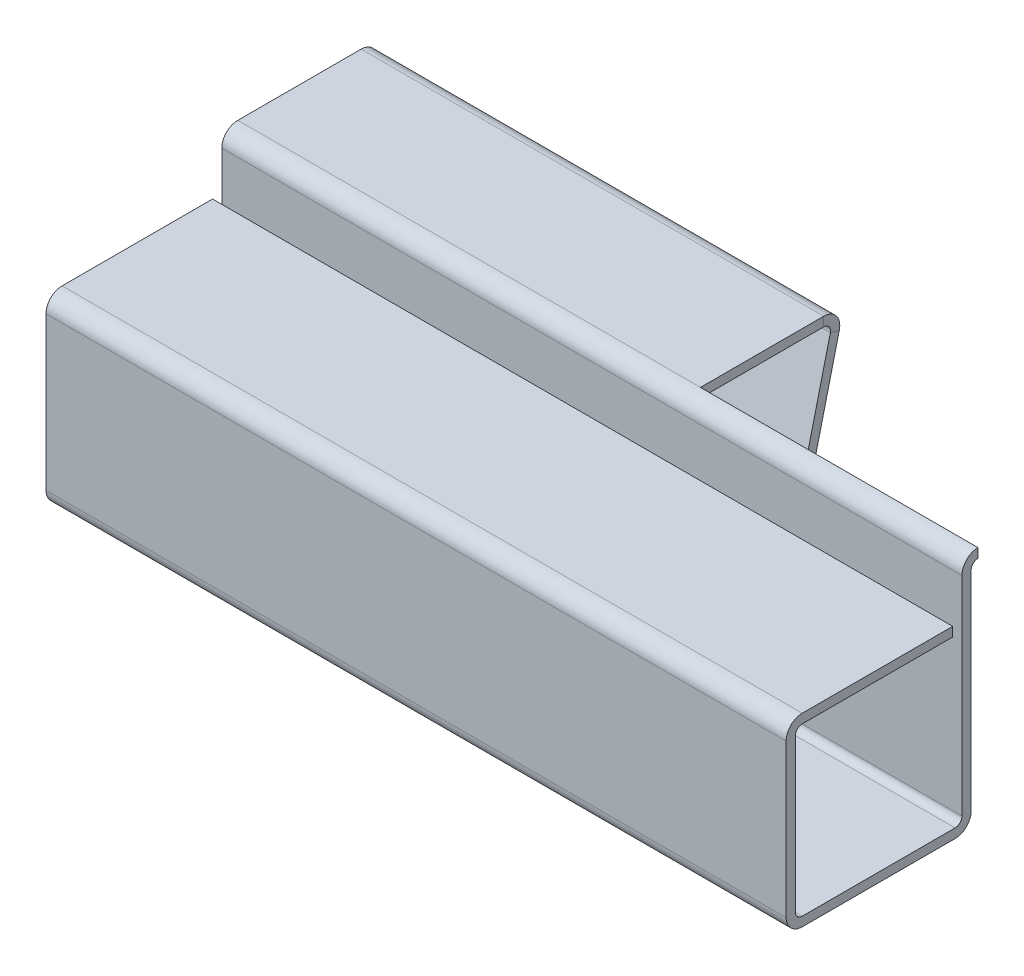
ISO-10303-21;
HEADER;
FILE_DESCRIPTION(('STEP AP214'),'2;1');
FILE_NAME('part.step','',(''),(''),'','','');
FILE_SCHEMA(('AUTOMOTIVE_DESIGN { 1 0 10303 214 1 1 1 1 }'));
ENDSEC;
DATA;
#1=APPLICATION_CONTEXT('core data for automotive mechanical design processes');
#2=APPLICATION_PROTOCOL_DEFINITION('international standard','automotive_design',2000,#1);
#3=PRODUCT_CONTEXT('',#1,'mechanical');
#4=PRODUCT('Part','Part','',(#3));
#5=PRODUCT_RELATED_PRODUCT_CATEGORY('part','',(#4));
#6=PRODUCT_DEFINITION_FORMATION('','',#4);
#7=PRODUCT_DEFINITION_CONTEXT('part definition',#1,'design');
#8=PRODUCT_DEFINITION('design','',#6,#7);
#9=PRODUCT_DEFINITION_SHAPE('','',#8);
#10=(LENGTH_UNIT() NAMED_UNIT(*) SI_UNIT(.MILLI.,.METRE.));
#11=(NAMED_UNIT(*) PLANE_ANGLE_UNIT() SI_UNIT($,.RADIAN.));
#12=(NAMED_UNIT(*) SI_UNIT($,.STERADIAN.) SOLID_ANGLE_UNIT());
#13=UNCERTAINTY_MEASURE_WITH_UNIT(LENGTH_MEASURE(1.E-05),#10,'distance_accuracy_value','');
#14=(GEOMETRIC_REPRESENTATION_CONTEXT(3) GLOBAL_UNCERTAINTY_ASSIGNED_CONTEXT((#13)) GLOBAL_UNIT_ASSIGNED_CONTEXT((#10,
#11,#12)) REPRESENTATION_CONTEXT('',''));
#15=CARTESIAN_POINT('',(0.,0.,0.));
#16=DIRECTION('',(0.,0.,1.));
#17=DIRECTION('',(1.,0.,0.));
#18=AXIS2_PLACEMENT_3D('',#15,#16,#17);
#19=CARTESIAN_POINT('',(50.,35.,-7.6326695579513));
#20=DIRECTION('',(1.,0.,0.));
#21=DIRECTION('',(0.,0.,-1.));
#22=AXIS2_PLACEMENT_3D('',#19,#20,#21);
#23=PLANE('',#22);
#24=DIRECTION('',(0.,1.,0.));
#25=VECTOR('',#24,1.);
#26=CARTESIAN_POINT('',(50.,35.,-7.6326695579513));
#27=LINE('',#26,#25);
#28=CARTESIAN_POINT('',(50.,35.,-7.6326695579513));
#29=VERTEX_POINT('',#28);
#30=CARTESIAN_POINT('',(50.,36.,-7.6326695579513));
#31=VERTEX_POINT('',#30);
#32=EDGE_CURVE('E11',#29,#31,#27,.T.);
#33=ORIENTED_EDGE('',*,*,#32,.F.);
#34=CARTESIAN_POINT('',(50.,34.2634,-7.6326695579513));
#35=DIRECTION('',(-1.,0.,0.));
#36=DIRECTION('',(0.,0.,1.));
#37=AXIS2_PLACEMENT_3D('',#34,#35,#36);
#38=CIRCLE('',#37,0.7366);
#39=CARTESIAN_POINT('',(50.,34.0881858939392,-8.34812715769941));
#40=VERTEX_POINT('',#39);
#41=EDGE_CURVE('E171',#40,#29,#38,.F.);
#42=ORIENTED_EDGE('',*,*,#41,.F.);
#43=DIRECTION('',(0.,0.237868729379253,0.971297311631974));
#44=VECTOR('',#43,1.);
#45=CARTESIAN_POINT('',(50.,33.85031716456,-9.31942446933138));
#46=LINE('',#45,#44);
#47=CARTESIAN_POINT('',(50.,33.85031716456,-9.31942446933138));
#48=VERTEX_POINT('',#47);
#49=EDGE_CURVE('E49',#48,#40,#46,.T.);
#50=ORIENTED_EDGE('',*,*,#49,.F.);
#51=CARTESIAN_POINT('',(50.,34.2634,-7.6326695579513));
#52=DIRECTION('',(1.,0.,0.));
#53=DIRECTION('',(0.,0.,-1.));
#54=AXIS2_PLACEMENT_3D('',#51,#52,#53);
#55=CIRCLE('',#54,1.7366);
#56=EDGE_CURVE('E168',#48,#31,#55,.T.);
#57=ORIENTED_EDGE('',*,*,#56,.T.);
#58=EDGE_LOOP('',(#33,#42,#50,#57));
#59=FACE_BOUND('',#58,.T.);
#60=ADVANCED_FACE('F41',(#59),#23,.T.);
#61=CARTESIAN_POINT('',(50.,33.85031716456,-9.31942446933138));
#62=DIRECTION('',(1.,0.,0.));
#63=DIRECTION('',(0.,0.,-1.));
#64=AXIS2_PLACEMENT_3D('',#61,#62,#63);
#65=PLANE('',#64);
#66=DIRECTION('',(0.,0.,1.));
#67=VECTOR('',#66,1.);
#68=CARTESIAN_POINT('',(50.,35.,-8.57142857142857));
#69=LINE('',#68,#67);
#70=CARTESIAN_POINT('',(50.,35.,5.69197142857143));
#71=VERTEX_POINT('',#70);
#72=EDGE_CURVE('E271',#29,#71,#69,.T.);
#73=ORIENTED_EDGE('',*,*,#72,.F.);
#74=ORIENTED_EDGE('',*,*,#32,.T.);
#75=DIRECTION('',(0.,0.,-1.));
#76=VECTOR('',#75,1.);
#77=CARTESIAN_POINT('',(50.,36.,-8.57142857142857));
#78=LINE('',#77,#76);
#79=CARTESIAN_POINT('',(50.,36.,5.69197142857143));
#80=VERTEX_POINT('',#79);
#81=EDGE_CURVE('E56',#31,#80,#78,.F.);
#82=ORIENTED_EDGE('',*,*,#81,.T.);
#83=DIRECTION('',(0.,-1.,0.));
#84=VECTOR('',#83,1.);
#85=CARTESIAN_POINT('',(50.,36.,5.69197142857143));
#86=LINE('',#85,#84);
#87=EDGE_CURVE('E146',#80,#71,#86,.T.);
#88=ORIENTED_EDGE('',*,*,#87,.T.);
#89=EDGE_LOOP('',(#73,#74,#82,#88));
#90=FACE_BOUND('',#89,.T.);
#91=ADVANCED_FACE('F413',(#90),#65,.T.);
#92=CARTESIAN_POINT('',(0.,34.0881858939392,-8.34812715769941));
#93=DIRECTION('',(-1.,0.,0.));
#94=DIRECTION('',(0.,0.,1.));
#95=AXIS2_PLACEMENT_3D('',#92,#93,#94);
#96=PLANE('',#95);
#97=DIRECTION('',(0.,-0.237868729379253,-0.971297311631974));
#98=VECTOR('',#97,1.);
#99=CARTESIAN_POINT('',(0.,34.0881858939392,-8.34812715769941));
#100=LINE('',#99,#98);
#101=CARTESIAN_POINT('',(0.,34.0881858939392,-8.34812715769941));
#102=VERTEX_POINT('',#101);
#103=CARTESIAN_POINT('',(0.,33.85031716456,-9.31942446933138));
#104=VERTEX_POINT('',#103);
#105=EDGE_CURVE('E176',#102,#104,#100,.T.);
#106=ORIENTED_EDGE('',*,*,#105,.F.);
#107=CARTESIAN_POINT('',(0.,34.2634,-7.6326695579513));
#108=DIRECTION('',(-1.,0.,0.));
#109=DIRECTION('',(0.,0.,1.));
#110=AXIS2_PLACEMENT_3D('',#107,#108,#109);
#111=CIRCLE('',#110,0.7366);
#112=CARTESIAN_POINT('',(0.,35.,-7.6326695579513));
#113=VERTEX_POINT('',#112);
#114=EDGE_CURVE('E237',#102,#113,#111,.F.);
#115=ORIENTED_EDGE('',*,*,#114,.T.);
#116=DIRECTION('',(0.,-1.,0.));
#117=VECTOR('',#116,1.);
#118=CARTESIAN_POINT('',(0.,36.,-7.6326695579513));
#119=LINE('',#118,#117);
#120=CARTESIAN_POINT('',(0.,36.,-7.6326695579513));
#121=VERTEX_POINT('',#120);
#122=EDGE_CURVE('E348',#121,#113,#119,.T.);
#123=ORIENTED_EDGE('',*,*,#122,.F.);
#124=CARTESIAN_POINT('',(0.,34.2634,-7.6326695579513));
#125=DIRECTION('',(1.,0.,0.));
#126=DIRECTION('',(0.,0.,-1.));
#127=AXIS2_PLACEMENT_3D('',#124,#125,#126);
#128=CIRCLE('',#127,1.7366);
#129=EDGE_CURVE('E247',#104,#121,#128,.T.);
#130=ORIENTED_EDGE('',*,*,#129,.F.);
#131=EDGE_LOOP('',(#106,#115,#123,#130));
#132=FACE_BOUND('',#131,.T.);
#133=ADVANCED_FACE('F355',(#132),#96,.T.);
#134=CARTESIAN_POINT('',(0.,36.,-7.6326695579513));
#135=DIRECTION('',(-1.,0.,0.));
#136=DIRECTION('',(0.,0.,1.));
#137=AXIS2_PLACEMENT_3D('',#134,#135,#136);
#138=PLANE('',#137);
#139=DIRECTION('',(0.,0.971297311631973,-0.237868729379259));
#140=VECTOR('',#139,1.);
#141=CARTESIAN_POINT('',(0.,0.,0.));
#142=LINE('',#141,#140);
#143=CARTESIAN_POINT('',(0.,0.,0.));
#144=VERTEX_POINT('',#143);
#145=EDGE_CURVE('E240',#144,#102,#142,.T.);
#146=ORIENTED_EDGE('',*,*,#145,.T.);
#147=ORIENTED_EDGE('',*,*,#105,.T.);
#148=DIRECTION('',(0.,0.971297311631973,-0.237868729379259));
#149=VECTOR('',#148,1.);
#150=CARTESIAN_POINT('',(0.,-0.237868729379259,-0.971297311631973));
#151=LINE('',#150,#149);
#152=CARTESIAN_POINT('',(0.,-0.237868729379259,-0.971297311631973));
#153=VERTEX_POINT('',#152);
#154=EDGE_CURVE('E191',#153,#104,#151,.T.);
#155=ORIENTED_EDGE('',*,*,#154,.F.);
#156=DIRECTION('',(0.,0.237868729379259,0.971297311631973));
#157=VECTOR('',#156,1.);
#158=CARTESIAN_POINT('',(0.,-0.237868729379259,-0.971297311631973));
#159=LINE('',#158,#157);
#160=EDGE_CURVE('E243',#153,#144,#159,.T.);
#161=ORIENTED_EDGE('',*,*,#160,.T.);
#162=EDGE_LOOP('',(#146,#147,#155,#161));
#163=FACE_BOUND('',#162,.T.);
#164=ADVANCED_FACE('F351',(#163),#138,.T.);
#165=CARTESIAN_POINT('',(0.,35.,5.69197142857143));
#166=DIRECTION('',(-1.,0.,0.));
#167=DIRECTION('',(0.,0.,1.));
#168=AXIS2_PLACEMENT_3D('',#165,#166,#167);
#169=PLANE('',#168);
#170=DIRECTION('',(0.,1.,0.));
#171=VECTOR('',#170,1.);
#172=CARTESIAN_POINT('',(0.,35.,5.69197142857143));
#173=LINE('',#172,#171);
#174=CARTESIAN_POINT('',(0.,35.,5.69197142857143));
#175=VERTEX_POINT('',#174);
#176=CARTESIAN_POINT('',(0.,36.,5.69197142857143));
#177=VERTEX_POINT('',#176);
#178=EDGE_CURVE('E345',#175,#177,#173,.T.);
#179=ORIENTED_EDGE('',*,*,#178,.F.);
#180=CARTESIAN_POINT('',(0.,34.2634,5.69197142857143));
#181=DIRECTION('',(-1.,0.,0.));
#182=DIRECTION('',(0.,0.,1.));
#183=AXIS2_PLACEMENT_3D('',#180,#181,#182);
#184=CIRCLE('',#183,0.7366);
#185=CARTESIAN_POINT('',(0.,34.2634,6.42857142857143));
#186=VERTEX_POINT('',#185);
#187=EDGE_CURVE('E231',#175,#186,#184,.F.);
#188=ORIENTED_EDGE('',*,*,#187,.T.);
#189=DIRECTION('',(0.,0.,-1.));
#190=VECTOR('',#189,1.);
#191=CARTESIAN_POINT('',(0.,34.2634,7.42857142857143));
#192=LINE('',#191,#190);
#193=CARTESIAN_POINT('',(0.,34.2634,7.42857142857143));
#194=VERTEX_POINT('',#193);
#195=EDGE_CURVE('E343',#194,#186,#192,.T.);
#196=ORIENTED_EDGE('',*,*,#195,.F.);
#197=CARTESIAN_POINT('',(0.,34.2634,5.69197142857143));
#198=DIRECTION('',(1.,0.,0.));
#199=DIRECTION('',(0.,0.,-1.));
#200=AXIS2_PLACEMENT_3D('',#197,#198,#199);
#201=CIRCLE('',#200,1.7366);
#202=EDGE_CURVE('E252',#177,#194,#201,.T.);
#203=ORIENTED_EDGE('',*,*,#202,.F.);
#204=EDGE_LOOP('',(#179,#188,#196,#203));
#205=FACE_BOUND('',#204,.T.);
#206=ADVANCED_FACE('F426',(#205),#169,.T.);
#207=CARTESIAN_POINT('',(0.,34.2634,7.42857142857143));
#208=DIRECTION('',(-1.,0.,0.));
#209=DIRECTION('',(0.,0.,1.));
#210=AXIS2_PLACEMENT_3D('',#207,#208,#209);
#211=PLANE('',#210);
#212=DIRECTION('',(0.,0.,1.));
#213=VECTOR('',#212,1.);
#214=CARTESIAN_POINT('',(0.,35.,-8.57142857142857));
#215=LINE('',#214,#213);
#216=EDGE_CURVE('E234',#113,#175,#215,.T.);
#217=ORIENTED_EDGE('',*,*,#216,.T.);
#218=ORIENTED_EDGE('',*,*,#178,.T.);
#219=DIRECTION('',(0.,0.,-1.));
#220=VECTOR('',#219,1.);
#221=CARTESIAN_POINT('',(0.,36.,-8.57142857142857));
#222=LINE('',#221,#220);
#223=EDGE_CURVE('E249',#121,#177,#222,.F.);
#224=ORIENTED_EDGE('',*,*,#223,.F.);
#225=ORIENTED_EDGE('',*,*,#122,.T.);
#226=EDGE_LOOP('',(#217,#218,#224,#225));
#227=FACE_BOUND('',#226,.T.);
#228=ADVANCED_FACE('F369',(#227),#211,.T.);
#229=CARTESIAN_POINT('',(0.,11.7366,6.42857142857142));
#230=DIRECTION('',(-1.,0.,0.));
#231=DIRECTION('',(0.,0.,1.));
#232=AXIS2_PLACEMENT_3D('',#229,#230,#231);
#233=PLANE('',#232);
#234=DIRECTION('',(0.,0.,1.));
#235=VECTOR('',#234,1.);
#236=CARTESIAN_POINT('',(0.,11.7366,6.42857142857142));
#237=LINE('',#236,#235);
#238=CARTESIAN_POINT('',(0.,11.7366,6.42857142857142));
#239=VERTEX_POINT('',#238);
#240=CARTESIAN_POINT('',(0.,11.7366,7.42857142857142));
#241=VERTEX_POINT('',#240);
#242=EDGE_CURVE('E341',#239,#241,#237,.T.);
#243=ORIENTED_EDGE('',*,*,#242,.F.);
#244=CARTESIAN_POINT('',(0.,11.7366,8.16517142857142));
#245=DIRECTION('',(1.,0.,0.));
#246=DIRECTION('',(0.,0.,-1.));
#247=AXIS2_PLACEMENT_3D('',#244,#245,#246);
#248=CIRCLE('',#247,1.7366);
#249=CARTESIAN_POINT('',(0.,10.,8.16517142857142));
#250=VERTEX_POINT('',#249);
#251=EDGE_CURVE('E225',#239,#250,#248,.F.);
#252=ORIENTED_EDGE('',*,*,#251,.T.);
#253=DIRECTION('',(0.,-1.,0.));
#254=VECTOR('',#253,1.);
#255=CARTESIAN_POINT('',(0.,11.,8.16517142857142));
#256=LINE('',#255,#254);
#257=CARTESIAN_POINT('',(0.,11.,8.16517142857142));
#258=VERTEX_POINT('',#257);
#259=EDGE_CURVE('E339',#258,#250,#256,.T.);
#260=ORIENTED_EDGE('',*,*,#259,.F.);
#261=CARTESIAN_POINT('',(0.,11.7366,8.16517142857142));
#262=DIRECTION('',(1.,0.,0.));
#263=DIRECTION('',(0.,0.,-1.));
#264=AXIS2_PLACEMENT_3D('',#261,#262,#263);
#265=CIRCLE('',#264,0.7366);
#266=EDGE_CURVE('E258',#241,#258,#265,.F.);
#267=ORIENTED_EDGE('',*,*,#266,.F.);
#268=EDGE_LOOP('',(#243,#252,#260,#267));
#269=FACE_BOUND('',#268,.T.);
#270=ADVANCED_FACE('F432',(#269),#233,.T.);
#271=CARTESIAN_POINT('',(0.,11.,8.16517142857142));
#272=DIRECTION('',(-1.,0.,0.));
#273=DIRECTION('',(0.,0.,1.));
#274=AXIS2_PLACEMENT_3D('',#271,#272,#273);
#275=PLANE('',#274);
#276=DIRECTION('',(0.,-1.,0.));
#277=VECTOR('',#276,1.);
#278=CARTESIAN_POINT('',(0.,35.,6.42857142857143));
#279=LINE('',#278,#277);
#280=EDGE_CURVE('E228',#186,#239,#279,.T.);
#281=ORIENTED_EDGE('',*,*,#280,.T.);
#282=ORIENTED_EDGE('',*,*,#242,.T.);
#283=DIRECTION('',(0.,-1.,0.));
#284=VECTOR('',#283,1.);
#285=CARTESIAN_POINT('',(0.,35.,7.42857142857143));
#286=LINE('',#285,#284);
#287=EDGE_CURVE('E255',#194,#241,#286,.T.);
#288=ORIENTED_EDGE('',*,*,#287,.F.);
#289=ORIENTED_EDGE('',*,*,#195,.T.);
#290=EDGE_LOOP('',(#281,#282,#288,#289));
#291=FACE_BOUND('',#290,.T.);
#292=ADVANCED_FACE('F435',(#291),#275,.T.);
#293=CARTESIAN_POINT('',(0.,10.,24.6919714285714));
#294=DIRECTION('',(-1.,0.,0.));
#295=DIRECTION('',(0.,0.,1.));
#296=AXIS2_PLACEMENT_3D('',#293,#294,#295);
#297=PLANE('',#296);
#298=DIRECTION('',(0.,1.,0.));
#299=VECTOR('',#298,1.);
#300=CARTESIAN_POINT('',(0.,10.,24.6919714285714));
#301=LINE('',#300,#299);
#302=CARTESIAN_POINT('',(0.,10.,24.6919714285714));
#303=VERTEX_POINT('',#302);
#304=CARTESIAN_POINT('',(0.,11.,24.6919714285714));
#305=VERTEX_POINT('',#304);
#306=EDGE_CURVE('E337',#303,#305,#301,.T.);
#307=ORIENTED_EDGE('',*,*,#306,.F.);
#308=CARTESIAN_POINT('',(0.,11.7366,24.6919714285714));
#309=DIRECTION('',(1.,0.,0.));
#310=DIRECTION('',(0.,0.,-1.));
#311=AXIS2_PLACEMENT_3D('',#308,#309,#310);
#312=CIRCLE('',#311,1.7366);
#313=CARTESIAN_POINT('',(0.,11.7366,26.4285714285714));
#314=VERTEX_POINT('',#313);
#315=EDGE_CURVE('E219',#303,#314,#312,.F.);
#316=ORIENTED_EDGE('',*,*,#315,.T.);
#317=DIRECTION('',(0.,0.,1.));
#318=VECTOR('',#317,1.);
#319=CARTESIAN_POINT('',(0.,11.7366,25.4285714285714));
#320=LINE('',#319,#318);
#321=CARTESIAN_POINT('',(0.,11.7366,25.4285714285714));
#322=VERTEX_POINT('',#321);
#323=EDGE_CURVE('E335',#322,#314,#320,.T.);
#324=ORIENTED_EDGE('',*,*,#323,.F.);
#325=CARTESIAN_POINT('',(0.,11.7366,24.6919714285714));
#326=DIRECTION('',(1.,0.,0.));
#327=DIRECTION('',(0.,0.,-1.));
#328=AXIS2_PLACEMENT_3D('',#325,#326,#327);
#329=CIRCLE('',#328,0.7366);
#330=EDGE_CURVE('E264',#305,#322,#329,.F.);
#331=ORIENTED_EDGE('',*,*,#330,.F.);
#332=EDGE_LOOP('',(#307,#316,#324,#331));
#333=FACE_BOUND('',#332,.T.);
#334=ADVANCED_FACE('F439',(#333),#297,.T.);
#335=CARTESIAN_POINT('',(0.,11.7366,25.4285714285714));
#336=DIRECTION('',(-1.,0.,0.));
#337=DIRECTION('',(0.,0.,1.));
#338=AXIS2_PLACEMENT_3D('',#335,#336,#337);
#339=PLANE('',#338);
#340=DIRECTION('',(0.,0.,1.));
#341=VECTOR('',#340,1.);
#342=CARTESIAN_POINT('',(0.,10.,6.42857142857142));
#343=LINE('',#342,#341);
#344=EDGE_CURVE('E222',#250,#303,#343,.T.);
#345=ORIENTED_EDGE('',*,*,#344,.T.);
#346=ORIENTED_EDGE('',*,*,#306,.T.);
#347=DIRECTION('',(0.,0.,1.));
#348=VECTOR('',#347,1.);
#349=CARTESIAN_POINT('',(0.,11.,6.42857142857142));
#350=LINE('',#349,#348);
#351=EDGE_CURVE('E261',#258,#305,#350,.T.);
#352=ORIENTED_EDGE('',*,*,#351,.F.);
#353=ORIENTED_EDGE('',*,*,#259,.T.);
#354=EDGE_LOOP('',(#345,#346,#352,#353));
#355=FACE_BOUND('',#354,.T.);
#356=ADVANCED_FACE('F443',(#355),#339,.T.);
#357=CARTESIAN_POINT('',(0.,28.2634,26.4285714285714));
#358=DIRECTION('',(-1.,0.,0.));
#359=DIRECTION('',(0.,0.,1.));
#360=AXIS2_PLACEMENT_3D('',#357,#358,#359);
#361=PLANE('',#360);
#362=DIRECTION('',(0.,0.,-1.));
#363=VECTOR('',#362,1.);
#364=CARTESIAN_POINT('',(0.,28.2634,26.4285714285714));
#365=LINE('',#364,#363);
#366=CARTESIAN_POINT('',(0.,28.2634,26.4285714285714));
#367=VERTEX_POINT('',#366);
#368=CARTESIAN_POINT('',(0.,28.2634,25.4285714285714));
#369=VERTEX_POINT('',#368);
#370=EDGE_CURVE('E133',#367,#369,#365,.T.);
#371=ORIENTED_EDGE('',*,*,#370,.F.);
#372=CARTESIAN_POINT('',(0.,28.2634,24.6919714285714));
#373=DIRECTION('',(1.,0.,0.));
#374=DIRECTION('',(0.,0.,-1.));
#375=AXIS2_PLACEMENT_3D('',#372,#373,#374);
#376=CIRCLE('',#375,1.7366);
#377=CARTESIAN_POINT('',(0.,30.,24.6919714285714));
#378=VERTEX_POINT('',#377);
#379=EDGE_CURVE('E215',#367,#378,#376,.F.);
#380=ORIENTED_EDGE('',*,*,#379,.T.);
#381=DIRECTION('',(0.,1.,0.));
#382=VECTOR('',#381,1.);
#383=CARTESIAN_POINT('',(0.,29.,24.6919714285714));
#384=LINE('',#383,#382);
#385=CARTESIAN_POINT('',(0.,29.,24.6919714285714));
#386=VERTEX_POINT('',#385);
#387=EDGE_CURVE('E140',#386,#378,#384,.T.);
#388=ORIENTED_EDGE('',*,*,#387,.F.);
#389=CARTESIAN_POINT('',(0.,28.2634,24.6919714285714));
#390=DIRECTION('',(1.,0.,0.));
#391=DIRECTION('',(0.,0.,-1.));
#392=AXIS2_PLACEMENT_3D('',#389,#390,#391);
#393=CIRCLE('',#392,0.7366);
#394=EDGE_CURVE('E269',#369,#386,#393,.F.);
#395=ORIENTED_EDGE('',*,*,#394,.F.);
#396=EDGE_LOOP('',(#371,#380,#388,#395));
#397=FACE_BOUND('',#396,.T.);
#398=ADVANCED_FACE('F447',(#397),#361,.T.);
#399=CARTESIAN_POINT('',(0.,29.,24.6919714285714));
#400=DIRECTION('',(-1.,0.,0.));
#401=DIRECTION('',(0.,0.,1.));
#402=AXIS2_PLACEMENT_3D('',#399,#400,#401);
#403=PLANE('',#402);
#404=DIRECTION('',(0.,1.,0.));
#405=VECTOR('',#404,1.);
#406=CARTESIAN_POINT('',(0.,10.,26.4285714285714));
#407=LINE('',#406,#405);
#408=EDGE_CURVE('E217',#314,#367,#407,.T.);
#409=ORIENTED_EDGE('',*,*,#408,.T.);
#410=ORIENTED_EDGE('',*,*,#370,.T.);
#411=DIRECTION('',(0.,1.,0.));
#412=VECTOR('',#411,1.);
#413=CARTESIAN_POINT('',(0.,10.,25.4285714285714));
#414=LINE('',#413,#412);
#415=EDGE_CURVE('E267',#322,#369,#414,.T.);
#416=ORIENTED_EDGE('',*,*,#415,.F.);
#417=ORIENTED_EDGE('',*,*,#323,.T.);
#418=EDGE_LOOP('',(#409,#410,#416,#417));
#419=FACE_BOUND('',#418,.T.);
#420=ADVANCED_FACE('F451',(#419),#403,.T.);
#421=CARTESIAN_POINT('',(50.,29.,26.4285714285714));
#422=DIRECTION('',(0.,1.,0.));
#423=DIRECTION('',(0.,0.,1.));
#424=AXIS2_PLACEMENT_3D('',#421,#422,#423);
#425=PLANE('',#424);
#426=DIRECTION('',(0.,0.,-1.));
#427=VECTOR('',#426,1.);
#428=CARTESIAN_POINT('',(0.,29.,26.4285714285714));
#429=LINE('',#428,#427);
#430=CARTESIAN_POINT('',(0.,29.,8.42857142857142));
#431=VERTEX_POINT('',#430);
#432=EDGE_CURVE('E205',#386,#431,#429,.T.);
#433=ORIENTED_EDGE('',*,*,#432,.T.);
#434=DIRECTION('',(-1.,0.,0.));
#435=VECTOR('',#434,1.);
#436=CARTESIAN_POINT('',(50.,29.,8.42857142857142));
#437=LINE('',#436,#435);
#438=CARTESIAN_POINT('',(80.,29.,8.42857142857142));
#439=VERTEX_POINT('',#438);
#440=EDGE_CURVE('E331',#439,#431,#437,.T.);
#441=ORIENTED_EDGE('',*,*,#440,.F.);
#442=DIRECTION('',(0.,0.,-1.));
#443=VECTOR('',#442,1.);
#444=CARTESIAN_POINT('',(80.,29.,25.4285714285714));
#445=LINE('',#444,#443);
#446=CARTESIAN_POINT('',(80.,29.,24.6919714285714));
#447=VERTEX_POINT('',#446);
#448=EDGE_CURVE('E927',#447,#439,#445,.T.);
#449=ORIENTED_EDGE('',*,*,#448,.F.);
#450=DIRECTION('',(-1.,0.,0.));
#451=VECTOR('',#450,1.);
#452=CARTESIAN_POINT('',(50.,29.,24.6919714285714));
#453=LINE('',#452,#451);
#454=EDGE_CURVE('E201',#447,#386,#453,.T.);
#455=ORIENTED_EDGE('',*,*,#454,.T.);
#456=EDGE_LOOP('',(#433,#441,#449,#455));
#457=FACE_BOUND('',#456,.T.);
#458=ADVANCED_FACE('F454',(#457),#425,.F.);
#459=CARTESIAN_POINT('',(50.,30.,8.42857142857142));
#460=DIRECTION('',(0.,0.,-1.));
#461=DIRECTION('',(-1.,0.,0.));
#462=AXIS2_PLACEMENT_3D('',#459,#460,#461);
#463=PLANE('',#462);
#464=DIRECTION('',(0.,-1.,0.));
#465=VECTOR('',#464,1.);
#466=CARTESIAN_POINT('',(0.,30.,8.42857142857142));
#467=LINE('',#466,#465);
#468=CARTESIAN_POINT('',(0.,30.,8.42857142857142));
#469=VERTEX_POINT('',#468);
#470=EDGE_CURVE('E208',#469,#431,#467,.T.);
#471=ORIENTED_EDGE('',*,*,#470,.F.);
#472=DIRECTION('',(-1.,0.,0.));
#473=VECTOR('',#472,1.);
#474=CARTESIAN_POINT('',(50.,30.,8.42857142857142));
#475=LINE('',#474,#473);
#476=CARTESIAN_POINT('',(80.,30.,8.42857142857142));
#477=VERTEX_POINT('',#476);
#478=EDGE_CURVE('E329',#477,#469,#475,.T.);
#479=ORIENTED_EDGE('',*,*,#478,.F.);
#480=DIRECTION('',(0.,1.,0.));
#481=VECTOR('',#480,1.);
#482=CARTESIAN_POINT('',(80.,28.2634,8.42857142857142));
#483=LINE('',#482,#481);
#484=EDGE_CURVE('E387',#477,#439,#483,.F.);
#485=ORIENTED_EDGE('',*,*,#484,.T.);
#486=ORIENTED_EDGE('',*,*,#440,.T.);
#487=EDGE_LOOP('',(#471,#479,#485,#486));
#488=FACE_BOUND('',#487,.T.);
#489=ADVANCED_FACE('F457',(#488),#463,.T.);
#490=CARTESIAN_POINT('',(50.,30.,26.4285714285714));
#491=DIRECTION('',(0.,1.,0.));
#492=DIRECTION('',(0.,0.,1.));
#493=AXIS2_PLACEMENT_3D('',#490,#491,#492);
#494=PLANE('',#493);
#495=DIRECTION('',(0.,0.,-1.));
#496=VECTOR('',#495,1.);
#497=CARTESIAN_POINT('',(0.,30.,26.4285714285714));
#498=LINE('',#497,#496);
#499=EDGE_CURVE('E212',#378,#469,#498,.T.);
#500=ORIENTED_EDGE('',*,*,#499,.F.);
#501=DIRECTION('',(-1.,0.,0.));
#502=VECTOR('',#501,1.);
#503=CARTESIAN_POINT('',(50.,30.,24.6919714285714));
#504=LINE('',#503,#502);
#505=CARTESIAN_POINT('',(80.,30.,24.6919714285714));
#506=VERTEX_POINT('',#505);
#507=EDGE_CURVE('E326',#506,#378,#504,.T.);
#508=ORIENTED_EDGE('',*,*,#507,.F.);
#509=DIRECTION('',(0.,0.,-1.));
#510=VECTOR('',#509,1.);
#511=CARTESIAN_POINT('',(80.,30.,25.4285714285714));
#512=LINE('',#511,#510);
#513=EDGE_CURVE('E939',#506,#477,#512,.T.);
#514=ORIENTED_EDGE('',*,*,#513,.T.);
#515=ORIENTED_EDGE('',*,*,#478,.T.);
#516=EDGE_LOOP('',(#500,#508,#514,#515));
#517=FACE_BOUND('',#516,.T.);
#518=ADVANCED_FACE('F461',(#517),#494,.T.);
#519=CARTESIAN_POINT('',(50.,28.2634,24.6919714285714));
#520=DIRECTION('',(-1.,0.,0.));
#521=DIRECTION('',(0.,0.,1.));
#522=AXIS2_PLACEMENT_3D('',#519,#520,#521);
#523=CYLINDRICAL_SURFACE('',#522,1.7366);
#524=ORIENTED_EDGE('',*,*,#379,.F.);
#525=DIRECTION('',(-1.,0.,0.));
#526=VECTOR('',#525,1.);
#527=CARTESIAN_POINT('',(50.,28.2634,26.4285714285714));
#528=LINE('',#527,#526);
#529=CARTESIAN_POINT('',(80.,28.2634,26.4285714285714));
#530=VERTEX_POINT('',#529);
#531=EDGE_CURVE('E323',#530,#367,#528,.T.);
#532=ORIENTED_EDGE('',*,*,#531,.F.);
#533=CARTESIAN_POINT('',(80.,28.2634,24.6919714285714));
#534=DIRECTION('',(1.,0.,0.));
#535=DIRECTION('',(0.,0.,-1.));
#536=AXIS2_PLACEMENT_3D('',#533,#534,#535);
#537=CIRCLE('',#536,1.7366);
#538=EDGE_CURVE('E945',#530,#506,#537,.F.);
#539=ORIENTED_EDGE('',*,*,#538,.T.);
#540=ORIENTED_EDGE('',*,*,#507,.T.);
#541=EDGE_LOOP('',(#524,#532,#539,#540));
#542=FACE_BOUND('',#541,.T.);
#543=ADVANCED_FACE('F465',(#542),#523,.T.);
#544=CARTESIAN_POINT('',(50.,10.,26.4285714285714));
#545=DIRECTION('',(0.,0.,1.));
#546=DIRECTION('',(1.,0.,0.));
#547=AXIS2_PLACEMENT_3D('',#544,#545,#546);
#548=PLANE('',#547);
#549=ORIENTED_EDGE('',*,*,#408,.F.);
#550=DIRECTION('',(-1.,0.,0.));
#551=VECTOR('',#550,1.);
#552=CARTESIAN_POINT('',(50.,11.7366,26.4285714285714));
#553=LINE('',#552,#551);
#554=CARTESIAN_POINT('',(80.,11.7366,26.4285714285714));
#555=VERTEX_POINT('',#554);
#556=EDGE_CURVE('E320',#555,#314,#553,.T.);
#557=ORIENTED_EDGE('',*,*,#556,.F.);
#558=DIRECTION('',(0.,1.,0.));
#559=VECTOR('',#558,1.);
#560=CARTESIAN_POINT('',(80.,11.,26.4285714285714));
#561=LINE('',#560,#559);
#562=EDGE_CURVE('E948',#555,#530,#561,.T.);
#563=ORIENTED_EDGE('',*,*,#562,.T.);
#564=ORIENTED_EDGE('',*,*,#531,.T.);
#565=EDGE_LOOP('',(#549,#557,#563,#564));
#566=FACE_BOUND('',#565,.T.);
#567=ADVANCED_FACE('F469',(#566),#548,.T.);
#568=CARTESIAN_POINT('',(50.,11.7366,24.6919714285714));
#569=DIRECTION('',(-1.,0.,0.));
#570=DIRECTION('',(0.,0.,1.));
#571=AXIS2_PLACEMENT_3D('',#568,#569,#570);
#572=CYLINDRICAL_SURFACE('',#571,1.7366);
#573=ORIENTED_EDGE('',*,*,#315,.F.);
#574=DIRECTION('',(-1.,0.,0.));
#575=VECTOR('',#574,1.);
#576=CARTESIAN_POINT('',(50.,10.,24.6919714285714));
#577=LINE('',#576,#575);
#578=CARTESIAN_POINT('',(80.,10.,24.6919714285714));
#579=VERTEX_POINT('',#578);
#580=EDGE_CURVE('E317',#579,#303,#577,.T.);
#581=ORIENTED_EDGE('',*,*,#580,.F.);
#582=CARTESIAN_POINT('',(80.,11.7366,24.6919714285714));
#583=DIRECTION('',(1.,0.,0.));
#584=DIRECTION('',(0.,0.,-1.));
#585=AXIS2_PLACEMENT_3D('',#582,#583,#584);
#586=CIRCLE('',#585,1.7366);
#587=EDGE_CURVE('E952',#579,#555,#586,.F.);
#588=ORIENTED_EDGE('',*,*,#587,.T.);
#589=ORIENTED_EDGE('',*,*,#556,.T.);
#590=EDGE_LOOP('',(#573,#581,#588,#589));
#591=FACE_BOUND('',#590,.T.);
#592=ADVANCED_FACE('F473',(#591),#572,.T.);
#593=CARTESIAN_POINT('',(50.,10.,6.42857142857142));
#594=DIRECTION('',(0.,-1.,0.));
#595=DIRECTION('',(0.,0.,-1.));
#596=AXIS2_PLACEMENT_3D('',#593,#594,#595);
#597=PLANE('',#596);
#598=ORIENTED_EDGE('',*,*,#344,.F.);
#599=DIRECTION('',(-1.,0.,0.));
#600=VECTOR('',#599,1.);
#601=CARTESIAN_POINT('',(50.,10.,8.16517142857142));
#602=LINE('',#601,#600);
#603=CARTESIAN_POINT('',(80.,10.,8.16517142857142));
#604=VERTEX_POINT('',#603);
#605=EDGE_CURVE('E314',#604,#250,#602,.T.);
#606=ORIENTED_EDGE('',*,*,#605,.F.);
#607=DIRECTION('',(0.,0.,-1.));
#608=VECTOR('',#607,1.);
#609=CARTESIAN_POINT('',(80.,10.,7.42857142857142));
#610=LINE('',#609,#608);
#611=EDGE_CURVE('E956',#604,#579,#610,.F.);
#612=ORIENTED_EDGE('',*,*,#611,.T.);
#613=ORIENTED_EDGE('',*,*,#580,.T.);
#614=EDGE_LOOP('',(#598,#606,#612,#613));
#615=FACE_BOUND('',#614,.T.);
#616=ADVANCED_FACE('F477',(#615),#597,.T.);
#617=CARTESIAN_POINT('',(50.,11.7366,8.16517142857142));
#618=DIRECTION('',(-1.,0.,0.));
#619=DIRECTION('',(0.,0.,1.));
#620=AXIS2_PLACEMENT_3D('',#617,#618,#619);
#621=CYLINDRICAL_SURFACE('',#620,1.7366);
#622=ORIENTED_EDGE('',*,*,#251,.F.);
#623=DIRECTION('',(-1.,0.,0.));
#624=VECTOR('',#623,1.);
#625=CARTESIAN_POINT('',(50.,11.7366,6.42857142857142));
#626=LINE('',#625,#624);
#627=CARTESIAN_POINT('',(80.,11.7366,6.42857142857142));
#628=VERTEX_POINT('',#627);
#629=EDGE_CURVE('E311',#628,#239,#626,.T.);
#630=ORIENTED_EDGE('',*,*,#629,.F.);
#631=CARTESIAN_POINT('',(80.,11.7366,8.16517142857142));
#632=DIRECTION('',(1.,0.,0.));
#633=DIRECTION('',(0.,0.,-1.));
#634=AXIS2_PLACEMENT_3D('',#631,#632,#633);
#635=CIRCLE('',#634,1.7366);
#636=EDGE_CURVE('E960',#628,#604,#635,.F.);
#637=ORIENTED_EDGE('',*,*,#636,.T.);
#638=ORIENTED_EDGE('',*,*,#605,.T.);
#639=EDGE_LOOP('',(#622,#630,#637,#638));
#640=FACE_BOUND('',#639,.T.);
#641=ADVANCED_FACE('F481',(#640),#621,.T.);
#642=CARTESIAN_POINT('',(50.,35.,6.42857142857143));
#643=DIRECTION('',(0.,0.,-1.));
#644=DIRECTION('',(0.,1.,0.));
#645=AXIS2_PLACEMENT_3D('',#642,#643,#644);
#646=PLANE('',#645);
#647=ORIENTED_EDGE('',*,*,#280,.F.);
#648=DIRECTION('',(-1.,0.,0.));
#649=VECTOR('',#648,1.);
#650=CARTESIAN_POINT('',(50.,34.2634,6.42857142857143));
#651=LINE('',#650,#649);
#652=CARTESIAN_POINT('',(80.,34.2634,6.42857142857143));
#653=VERTEX_POINT('',#652);
#654=EDGE_CURVE('E308',#653,#186,#651,.T.);
#655=ORIENTED_EDGE('',*,*,#654,.F.);
#656=DIRECTION('',(0.,1.,0.));
#657=VECTOR('',#656,1.);
#658=CARTESIAN_POINT('',(80.,36.,6.42857142857143));
#659=LINE('',#658,#657);
#660=EDGE_CURVE('E964',#653,#628,#659,.F.);
#661=ORIENTED_EDGE('',*,*,#660,.T.);
#662=ORIENTED_EDGE('',*,*,#629,.T.);
#663=EDGE_LOOP('',(#647,#655,#661,#662));
#664=FACE_BOUND('',#663,.T.);
#665=ADVANCED_FACE('F485',(#664),#646,.T.);
#666=CARTESIAN_POINT('',(50.,34.2634,5.69197142857143));
#667=DIRECTION('',(-1.,0.,0.));
#668=DIRECTION('',(0.,0.,1.));
#669=AXIS2_PLACEMENT_3D('',#666,#667,#668);
#670=CYLINDRICAL_SURFACE('',#669,0.7366);
#671=ORIENTED_EDGE('',*,*,#187,.F.);
#672=DIRECTION('',(-1.,0.,0.));
#673=VECTOR('',#672,1.);
#674=CARTESIAN_POINT('',(50.,35.,5.69197142857143));
#675=LINE('',#674,#673);
#676=EDGE_CURVE('E305',#71,#175,#675,.T.);
#677=ORIENTED_EDGE('',*,*,#676,.F.);
#678=DIRECTION('',(1.,0.,0.));
#679=VECTOR('',#678,1.);
#680=CARTESIAN_POINT('',(50.,35.,5.69197142857143));
#681=LINE('',#680,#679);
#682=CARTESIAN_POINT('',(80.,35.,5.69197142857143));
#683=VERTEX_POINT('',#682);
#684=EDGE_CURVE('E209',#71,#683,#681,.T.);
#685=ORIENTED_EDGE('',*,*,#684,.T.);
#686=CARTESIAN_POINT('',(80.,34.2634,5.69197142857143));
#687=DIRECTION('',(-1.,0.,0.));
#688=DIRECTION('',(0.,0.,1.));
#689=AXIS2_PLACEMENT_3D('',#686,#687,#688);
#690=CIRCLE('',#689,0.7366);
#691=EDGE_CURVE('E967',#683,#653,#690,.F.);
#692=ORIENTED_EDGE('',*,*,#691,.T.);
#693=ORIENTED_EDGE('',*,*,#654,.T.);
#694=EDGE_LOOP('',(#671,#677,#685,#692,#693));
#695=FACE_BOUND('',#694,.T.);
#696=ADVANCED_FACE('F489',(#695),#670,.F.);
#697=CARTESIAN_POINT('',(50.,35.,-8.57142857142857));
#698=DIRECTION('',(0.,-1.,0.));
#699=DIRECTION('',(0.,0.,-1.));
#700=AXIS2_PLACEMENT_3D('',#697,#698,#699);
#701=PLANE('',#700);
#702=ORIENTED_EDGE('',*,*,#216,.F.);
#703=DIRECTION('',(-1.,0.,0.));
#704=VECTOR('',#703,1.);
#705=CARTESIAN_POINT('',(50.,35.,-7.6326695579513));
#706=LINE('',#705,#704);
#707=EDGE_CURVE('E302',#29,#113,#706,.T.);
#708=ORIENTED_EDGE('',*,*,#707,.F.);
#709=ORIENTED_EDGE('',*,*,#72,.T.);
#710=ORIENTED_EDGE('',*,*,#676,.T.);
#711=EDGE_LOOP('',(#702,#708,#709,#710));
#712=FACE_BOUND('',#711,.T.);
#713=ADVANCED_FACE('F366',(#712),#701,.T.);
#714=CARTESIAN_POINT('',(50.,34.2634,-7.6326695579513));
#715=DIRECTION('',(-1.,0.,0.));
#716=DIRECTION('',(0.,0.,1.));
#717=AXIS2_PLACEMENT_3D('',#714,#715,#716);
#718=CYLINDRICAL_SURFACE('',#717,0.7366);
#719=ORIENTED_EDGE('',*,*,#114,.F.);
#720=DIRECTION('',(-1.,0.,0.));
#721=VECTOR('',#720,1.);
#722=CARTESIAN_POINT('',(50.,34.0881858939392,-8.34812715769941));
#723=LINE('',#722,#721);
#724=EDGE_CURVE('E299',#40,#102,#723,.T.);
#725=ORIENTED_EDGE('',*,*,#724,.F.);
#726=ORIENTED_EDGE('',*,*,#41,.T.);
#727=ORIENTED_EDGE('',*,*,#707,.T.);
#728=EDGE_LOOP('',(#719,#725,#726,#727));
#729=FACE_BOUND('',#728,.T.);
#730=ADVANCED_FACE('F361',(#729),#718,.F.);
#731=CARTESIAN_POINT('',(50.,0.,0.));
#732=DIRECTION('',(0.,0.237868729379259,0.971297311631973));
#733=DIRECTION('',(0.,-0.971297311631973,0.237868729379259));
#734=AXIS2_PLACEMENT_3D('',#731,#732,#733);
#735=PLANE('',#734);
#736=ORIENTED_EDGE('',*,*,#145,.F.);
#737=DIRECTION('',(-1.,0.,0.));
#738=VECTOR('',#737,1.);
#739=CARTESIAN_POINT('',(50.,0.,0.));
#740=LINE('',#739,#738);
#741=CARTESIAN_POINT('',(50.,0.,0.));
#742=VERTEX_POINT('',#741);
#743=EDGE_CURVE('E297',#742,#144,#740,.T.);
#744=ORIENTED_EDGE('',*,*,#743,.F.);
#745=DIRECTION('',(0.,0.971297311631973,-0.237868729379259));
#746=VECTOR('',#745,1.);
#747=CARTESIAN_POINT('',(50.,0.,0.));
#748=LINE('',#747,#746);
#749=EDGE_CURVE('E359',#742,#40,#748,.T.);
#750=ORIENTED_EDGE('',*,*,#749,.T.);
#751=ORIENTED_EDGE('',*,*,#724,.T.);
#752=EDGE_LOOP('',(#736,#744,#750,#751));
#753=FACE_BOUND('',#752,.T.);
#754=ADVANCED_FACE('F358',(#753),#735,.T.);
#755=CARTESIAN_POINT('',(50.,-0.237868729379259,-0.971297311631973));
#756=DIRECTION('',(0.,-0.971297311631973,0.237868729379259));
#757=DIRECTION('',(0.,-0.237868729379259,-0.971297311631973));
#758=AXIS2_PLACEMENT_3D('',#755,#756,#757);
#759=PLANE('',#758);
#760=ORIENTED_EDGE('',*,*,#160,.F.);
#761=DIRECTION('',(-1.,0.,0.));
#762=VECTOR('',#761,1.);
#763=CARTESIAN_POINT('',(50.,-0.237868729379259,-0.971297311631973));
#764=LINE('',#763,#762);
#765=CARTESIAN_POINT('',(50.,-0.237868729379259,-0.971297311631973));
#766=VERTEX_POINT('',#765);
#767=EDGE_CURVE('E195',#766,#153,#764,.T.);
#768=ORIENTED_EDGE('',*,*,#767,.F.);
#769=DIRECTION('',(0.,0.237868729379259,0.971297311631973));
#770=VECTOR('',#769,1.);
#771=CARTESIAN_POINT('',(50.,-0.237868729379259,-0.971297311631973));
#772=LINE('',#771,#770);
#773=EDGE_CURVE('E183',#766,#742,#772,.T.);
#774=ORIENTED_EDGE('',*,*,#773,.T.);
#775=ORIENTED_EDGE('',*,*,#743,.T.);
#776=EDGE_LOOP('',(#760,#768,#774,#775));
#777=FACE_BOUND('',#776,.T.);
#778=ADVANCED_FACE('F403',(#777),#759,.T.);
#779=CARTESIAN_POINT('',(50.,-0.237868729379259,-0.971297311631973));
#780=DIRECTION('',(0.,0.237868729379259,0.971297311631972));
#781=DIRECTION('',(0.,-0.971297311631973,0.237868729379259));
#782=AXIS2_PLACEMENT_3D('',#779,#780,#781);
#783=PLANE('',#782);
#784=ORIENTED_EDGE('',*,*,#154,.T.);
#785=DIRECTION('',(-1.,0.,0.));
#786=VECTOR('',#785,1.);
#787=CARTESIAN_POINT('',(50.,33.85031716456,-9.31942446933138));
#788=LINE('',#787,#786);
#789=EDGE_CURVE('E188',#48,#104,#788,.T.);
#790=ORIENTED_EDGE('',*,*,#789,.F.);
#791=DIRECTION('',(0.,0.971297311631973,-0.237868729379259));
#792=VECTOR('',#791,1.);
#793=CARTESIAN_POINT('',(50.,-0.237868729379259,-0.971297311631973));
#794=LINE('',#793,#792);
#795=EDGE_CURVE('E179',#766,#48,#794,.T.);
#796=ORIENTED_EDGE('',*,*,#795,.F.);
#797=ORIENTED_EDGE('',*,*,#767,.T.);
#798=EDGE_LOOP('',(#784,#790,#796,#797));
#799=FACE_BOUND('',#798,.T.);
#800=ADVANCED_FACE('F189',(#799),#783,.F.);
#801=CARTESIAN_POINT('',(50.,34.2634,-7.6326695579513));
#802=DIRECTION('',(-1.,0.,0.));
#803=DIRECTION('',(0.,0.,1.));
#804=AXIS2_PLACEMENT_3D('',#801,#802,#803);
#805=CYLINDRICAL_SURFACE('',#804,1.7366);
#806=ORIENTED_EDGE('',*,*,#129,.T.);
#807=DIRECTION('',(-1.,0.,0.));
#808=VECTOR('',#807,1.);
#809=CARTESIAN_POINT('',(50.,36.,-7.6326695579513));
#810=LINE('',#809,#808);
#811=EDGE_CURVE('E196',#31,#121,#810,.T.);
#812=ORIENTED_EDGE('',*,*,#811,.F.);
#813=ORIENTED_EDGE('',*,*,#56,.F.);
#814=ORIENTED_EDGE('',*,*,#789,.T.);
#815=EDGE_LOOP('',(#806,#812,#813,#814));
#816=FACE_BOUND('',#815,.T.);
#817=ADVANCED_FACE('F198',(#816),#805,.T.);
#818=CARTESIAN_POINT('',(50.,36.,-8.57142857142857));
#819=DIRECTION('',(0.,-1.,0.));
#820=DIRECTION('',(0.,0.,-1.));
#821=AXIS2_PLACEMENT_3D('',#818,#819,#820);
#822=PLANE('',#821);
#823=ORIENTED_EDGE('',*,*,#223,.T.);
#824=DIRECTION('',(-1.,0.,0.));
#825=VECTOR('',#824,1.);
#826=CARTESIAN_POINT('',(50.,36.,5.69197142857143));
#827=LINE('',#826,#825);
#828=EDGE_CURVE('E292',#80,#177,#827,.T.);
#829=ORIENTED_EDGE('',*,*,#828,.F.);
#830=ORIENTED_EDGE('',*,*,#81,.F.);
#831=ORIENTED_EDGE('',*,*,#811,.T.);
#832=EDGE_LOOP('',(#823,#829,#830,#831));
#833=FACE_BOUND('',#832,.T.);
#834=ADVANCED_FACE('F372',(#833),#822,.F.);
#835=CARTESIAN_POINT('',(50.,34.2634,5.69197142857143));
#836=DIRECTION('',(-1.,0.,0.));
#837=DIRECTION('',(0.,0.,1.));
#838=AXIS2_PLACEMENT_3D('',#835,#836,#837);
#839=CYLINDRICAL_SURFACE('',#838,1.7366);
#840=ORIENTED_EDGE('',*,*,#202,.T.);
#841=DIRECTION('',(-1.,0.,0.));
#842=VECTOR('',#841,1.);
#843=CARTESIAN_POINT('',(50.,34.2634,7.42857142857143));
#844=LINE('',#843,#842);
#845=CARTESIAN_POINT('',(80.,34.2634,7.42857142857143));
#846=VERTEX_POINT('',#845);
#847=EDGE_CURVE('E289',#846,#194,#844,.T.);
#848=ORIENTED_EDGE('',*,*,#847,.F.);
#849=CARTESIAN_POINT('',(80.,34.2634,5.69197142857143));
#850=DIRECTION('',(1.,0.,0.));
#851=DIRECTION('',(0.,0.,-1.));
#852=AXIS2_PLACEMENT_3D('',#849,#850,#851);
#853=CIRCLE('',#852,1.7366);
#854=CARTESIAN_POINT('',(80.,36.,5.69197142857143));
#855=VERTEX_POINT('',#854);
#856=EDGE_CURVE('E383',#855,#846,#853,.T.);
#857=ORIENTED_EDGE('',*,*,#856,.F.);
#858=DIRECTION('',(1.,0.,0.));
#859=VECTOR('',#858,1.);
#860=CARTESIAN_POINT('',(50.,36.,5.69197142857143));
#861=LINE('',#860,#859);
#862=EDGE_CURVE('E378',#80,#855,#861,.T.);
#863=ORIENTED_EDGE('',*,*,#862,.F.);
#864=ORIENTED_EDGE('',*,*,#828,.T.);
#865=EDGE_LOOP('',(#840,#848,#857,#863,#864));
#866=FACE_BOUND('',#865,.T.);
#867=ADVANCED_FACE('F379',(#866),#839,.T.);
#868=CARTESIAN_POINT('',(50.,35.,7.42857142857143));
#869=DIRECTION('',(0.,0.,-1.));
#870=DIRECTION('',(0.,1.,0.));
#871=AXIS2_PLACEMENT_3D('',#868,#869,#870);
#872=PLANE('',#871);
#873=ORIENTED_EDGE('',*,*,#287,.T.);
#874=DIRECTION('',(-1.,0.,0.));
#875=VECTOR('',#874,1.);
#876=CARTESIAN_POINT('',(50.,11.7366,7.42857142857142));
#877=LINE('',#876,#875);
#878=CARTESIAN_POINT('',(80.,11.7366,7.42857142857142));
#879=VERTEX_POINT('',#878);
#880=EDGE_CURVE('E286',#879,#241,#877,.T.);
#881=ORIENTED_EDGE('',*,*,#880,.F.);
#882=DIRECTION('',(0.,1.,0.));
#883=VECTOR('',#882,1.);
#884=CARTESIAN_POINT('',(80.,36.,7.42857142857143));
#885=LINE('',#884,#883);
#886=EDGE_CURVE('E961',#846,#879,#885,.F.);
#887=ORIENTED_EDGE('',*,*,#886,.F.);
#888=ORIENTED_EDGE('',*,*,#847,.T.);
#889=EDGE_LOOP('',(#873,#881,#887,#888));
#890=FACE_BOUND('',#889,.T.);
#891=ADVANCED_FACE('F609',(#890),#872,.F.);
#892=CARTESIAN_POINT('',(50.,11.7366,8.16517142857142));
#893=DIRECTION('',(-1.,0.,0.));
#894=DIRECTION('',(0.,0.,1.));
#895=AXIS2_PLACEMENT_3D('',#892,#893,#894);
#896=CYLINDRICAL_SURFACE('',#895,0.7366);
#897=ORIENTED_EDGE('',*,*,#266,.T.);
#898=DIRECTION('',(-1.,0.,0.));
#899=VECTOR('',#898,1.);
#900=CARTESIAN_POINT('',(50.,11.,8.16517142857142));
#901=LINE('',#900,#899);
#902=CARTESIAN_POINT('',(80.,11.,8.16517142857142));
#903=VERTEX_POINT('',#902);
#904=EDGE_CURVE('E283',#903,#258,#901,.T.);
#905=ORIENTED_EDGE('',*,*,#904,.F.);
#906=CARTESIAN_POINT('',(80.,11.7366,8.16517142857142));
#907=DIRECTION('',(1.,0.,0.));
#908=DIRECTION('',(0.,0.,-1.));
#909=AXIS2_PLACEMENT_3D('',#906,#907,#908);
#910=CIRCLE('',#909,0.7366);
#911=EDGE_CURVE('E957',#879,#903,#910,.F.);
#912=ORIENTED_EDGE('',*,*,#911,.F.);
#913=ORIENTED_EDGE('',*,*,#880,.T.);
#914=EDGE_LOOP('',(#897,#905,#912,#913));
#915=FACE_BOUND('',#914,.T.);
#916=ADVANCED_FACE('F617',(#915),#896,.F.);
#917=CARTESIAN_POINT('',(50.,11.,6.42857142857142));
#918=DIRECTION('',(0.,-1.,0.));
#919=DIRECTION('',(0.,0.,-1.));
#920=AXIS2_PLACEMENT_3D('',#917,#918,#919);
#921=PLANE('',#920);
#922=ORIENTED_EDGE('',*,*,#351,.T.);
#923=DIRECTION('',(-1.,0.,0.));
#924=VECTOR('',#923,1.);
#925=CARTESIAN_POINT('',(50.,11.,24.6919714285714));
#926=LINE('',#925,#924);
#927=CARTESIAN_POINT('',(80.,11.,24.6919714285714));
#928=VERTEX_POINT('',#927);
#929=EDGE_CURVE('E280',#928,#305,#926,.T.);
#930=ORIENTED_EDGE('',*,*,#929,.F.);
#931=DIRECTION('',(0.,0.,-1.));
#932=VECTOR('',#931,1.);
#933=CARTESIAN_POINT('',(80.,11.,7.42857142857142));
#934=LINE('',#933,#932);
#935=EDGE_CURVE('E953',#903,#928,#934,.F.);
#936=ORIENTED_EDGE('',*,*,#935,.F.);
#937=ORIENTED_EDGE('',*,*,#904,.T.);
#938=EDGE_LOOP('',(#922,#930,#936,#937));
#939=FACE_BOUND('',#938,.T.);
#940=ADVANCED_FACE('F625',(#939),#921,.F.);
#941=CARTESIAN_POINT('',(50.,11.7366,24.6919714285714));
#942=DIRECTION('',(-1.,0.,0.));
#943=DIRECTION('',(0.,0.,1.));
#944=AXIS2_PLACEMENT_3D('',#941,#942,#943);
#945=CYLINDRICAL_SURFACE('',#944,0.7366);
#946=ORIENTED_EDGE('',*,*,#330,.T.);
#947=DIRECTION('',(-1.,0.,0.));
#948=VECTOR('',#947,1.);
#949=CARTESIAN_POINT('',(50.,11.7366,25.4285714285714));
#950=LINE('',#949,#948);
#951=CARTESIAN_POINT('',(80.,11.7366,25.4285714285714));
#952=VERTEX_POINT('',#951);
#953=EDGE_CURVE('E277',#952,#322,#950,.T.);
#954=ORIENTED_EDGE('',*,*,#953,.F.);
#955=CARTESIAN_POINT('',(80.,11.7366,24.6919714285714));
#956=DIRECTION('',(1.,0.,0.));
#957=DIRECTION('',(0.,0.,-1.));
#958=AXIS2_PLACEMENT_3D('',#955,#956,#957);
#959=CIRCLE('',#958,0.7366);
#960=EDGE_CURVE('E949',#928,#952,#959,.F.);
#961=ORIENTED_EDGE('',*,*,#960,.F.);
#962=ORIENTED_EDGE('',*,*,#929,.T.);
#963=EDGE_LOOP('',(#946,#954,#961,#962));
#964=FACE_BOUND('',#963,.T.);
#965=ADVANCED_FACE('F633',(#964),#945,.F.);
#966=CARTESIAN_POINT('',(50.,10.,25.4285714285714));
#967=DIRECTION('',(0.,0.,1.));
#968=DIRECTION('',(1.,0.,0.));
#969=AXIS2_PLACEMENT_3D('',#966,#967,#968);
#970=PLANE('',#969);
#971=ORIENTED_EDGE('',*,*,#415,.T.);
#972=DIRECTION('',(-1.,0.,0.));
#973=VECTOR('',#972,1.);
#974=CARTESIAN_POINT('',(50.,28.2634,25.4285714285714));
#975=LINE('',#974,#973);
#976=CARTESIAN_POINT('',(80.,28.2634,25.4285714285714));
#977=VERTEX_POINT('',#976);
#978=EDGE_CURVE('E274',#977,#369,#975,.T.);
#979=ORIENTED_EDGE('',*,*,#978,.F.);
#980=DIRECTION('',(0.,1.,0.));
#981=VECTOR('',#980,1.);
#982=CARTESIAN_POINT('',(80.,11.,25.4285714285714));
#983=LINE('',#982,#981);
#984=EDGE_CURVE('E946',#952,#977,#983,.T.);
#985=ORIENTED_EDGE('',*,*,#984,.F.);
#986=ORIENTED_EDGE('',*,*,#953,.T.);
#987=EDGE_LOOP('',(#971,#979,#985,#986));
#988=FACE_BOUND('',#987,.T.);
#989=ADVANCED_FACE('F641',(#988),#970,.F.);
#990=CARTESIAN_POINT('',(50.,28.2634,24.6919714285714));
#991=DIRECTION('',(-1.,0.,0.));
#992=DIRECTION('',(0.,0.,1.));
#993=AXIS2_PLACEMENT_3D('',#990,#991,#992);
#994=CYLINDRICAL_SURFACE('',#993,0.7366);
#995=ORIENTED_EDGE('',*,*,#394,.T.);
#996=ORIENTED_EDGE('',*,*,#454,.F.);
#997=CARTESIAN_POINT('',(80.,28.2634,24.6919714285714));
#998=DIRECTION('',(1.,0.,0.));
#999=DIRECTION('',(0.,0.,-1.));
#1000=AXIS2_PLACEMENT_3D('',#997,#998,#999);
#1001=CIRCLE('',#1000,0.7366);
#1002=EDGE_CURVE('E938',#977,#447,#1001,.F.);
#1003=ORIENTED_EDGE('',*,*,#1002,.F.);
#1004=ORIENTED_EDGE('',*,*,#978,.T.);
#1005=EDGE_LOOP('',(#995,#996,#1003,#1004));
#1006=FACE_BOUND('',#1005,.T.);
#1007=ADVANCED_FACE('F539',(#1006),#994,.F.);
#1008=CARTESIAN_POINT('',(50.,28.2634,24.6919714285714));
#1009=DIRECTION('',(1.,0.,0.));
#1010=DIRECTION('',(0.,0.,-1.));
#1011=AXIS2_PLACEMENT_3D('',#1008,#1009,#1010);
#1012=PLANE('',#1011);
#1013=ORIENTED_EDGE('',*,*,#795,.T.);
#1014=ORIENTED_EDGE('',*,*,#49,.T.);
#1015=ORIENTED_EDGE('',*,*,#749,.F.);
#1016=ORIENTED_EDGE('',*,*,#773,.F.);
#1017=EDGE_LOOP('',(#1013,#1014,#1015,#1016));
#1018=FACE_BOUND('',#1017,.T.);
#1019=ADVANCED_FACE('F181',(#1018),#1012,.T.);
#1020=CARTESIAN_POINT('',(0.,28.2634,24.6919714285714));
#1021=DIRECTION('',(1.,0.,0.));
#1022=DIRECTION('',(0.,0.,-1.));
#1023=AXIS2_PLACEMENT_3D('',#1020,#1021,#1022);
#1024=PLANE('',#1023);
#1025=ORIENTED_EDGE('',*,*,#432,.F.);
#1026=ORIENTED_EDGE('',*,*,#387,.T.);
#1027=ORIENTED_EDGE('',*,*,#499,.T.);
#1028=ORIENTED_EDGE('',*,*,#470,.T.);
#1029=EDGE_LOOP('',(#1025,#1026,#1027,#1028));
#1030=FACE_BOUND('',#1029,.T.);
#1031=ADVANCED_FACE('F538',(#1030),#1024,.F.);
#1032=CARTESIAN_POINT('',(50.,36.,5.69197142857143));
#1033=DIRECTION('',(0.,0.,1.));
#1034=DIRECTION('',(0.,-1.,0.));
#1035=AXIS2_PLACEMENT_3D('',#1032,#1033,#1034);
#1036=PLANE('',#1035);
#1037=ORIENTED_EDGE('',*,*,#684,.F.);
#1038=ORIENTED_EDGE('',*,*,#87,.F.);
#1039=ORIENTED_EDGE('',*,*,#862,.T.);
#1040=DIRECTION('',(0.,1.,0.));
#1041=VECTOR('',#1040,1.);
#1042=CARTESIAN_POINT('',(80.,34.2634,5.69197142857143));
#1043=LINE('',#1042,#1041);
#1044=EDGE_CURVE('E393',#855,#683,#1043,.F.);
#1045=ORIENTED_EDGE('',*,*,#1044,.T.);
#1046=EDGE_LOOP('',(#1037,#1038,#1039,#1045));
#1047=FACE_BOUND('',#1046,.T.);
#1048=ADVANCED_FACE('F390',(#1047),#1036,.F.);
#1049=CARTESIAN_POINT('',(80.,34.2634,6.42857142857143));
#1050=DIRECTION('',(1.,0.,0.));
#1051=DIRECTION('',(0.,0.,-1.));
#1052=AXIS2_PLACEMENT_3D('',#1049,#1050,#1051);
#1053=PLANE('',#1052);
#1054=ORIENTED_EDGE('',*,*,#856,.T.);
#1055=ORIENTED_EDGE('',*,*,#886,.T.);
#1056=ORIENTED_EDGE('',*,*,#911,.T.);
#1057=ORIENTED_EDGE('',*,*,#935,.T.);
#1058=ORIENTED_EDGE('',*,*,#960,.T.);
#1059=ORIENTED_EDGE('',*,*,#984,.T.);
#1060=ORIENTED_EDGE('',*,*,#1002,.T.);
#1061=ORIENTED_EDGE('',*,*,#448,.T.);
#1062=ORIENTED_EDGE('',*,*,#484,.F.);
#1063=ORIENTED_EDGE('',*,*,#513,.F.);
#1064=ORIENTED_EDGE('',*,*,#538,.F.);
#1065=ORIENTED_EDGE('',*,*,#562,.F.);
#1066=ORIENTED_EDGE('',*,*,#587,.F.);
#1067=ORIENTED_EDGE('',*,*,#611,.F.);
#1068=ORIENTED_EDGE('',*,*,#636,.F.);
#1069=ORIENTED_EDGE('',*,*,#660,.F.);
#1070=ORIENTED_EDGE('',*,*,#691,.F.);
#1071=ORIENTED_EDGE('',*,*,#1044,.F.);
#1072=EDGE_LOOP('',(#1054,#1055,#1056,#1057,#1058,#1059,#1060,#1061,#1062,#1063,#1064,#1065,
#1066,#1067,#1068,#1069,#1070,#1071));
#1073=FACE_BOUND('',#1072,.T.);
#1074=ADVANCED_FACE('F557',(#1073),#1053,.T.);
#1075=CLOSED_SHELL('',(#60,#91,#133,#164,#206,#228,#270,#292,#334,#356,#398,#420,#458,#489,#518,
#543,#567,#592,#616,#641,#665,#696,#713,#730,#754,#778,#800,#817,#834,#867,#891,#916,#940,#965,
#989,#1007,#1019,#1031,#1048,#1074));
#1076=MANIFOLD_SOLID_BREP('B2',#1075);
#1077=ADVANCED_BREP_SHAPE_REPRESENTATION('',(#18,#1076),#14);
#1078=SHAPE_DEFINITION_REPRESENTATION(#9,#1077);
ENDSEC;
END-ISO-10303-21;
